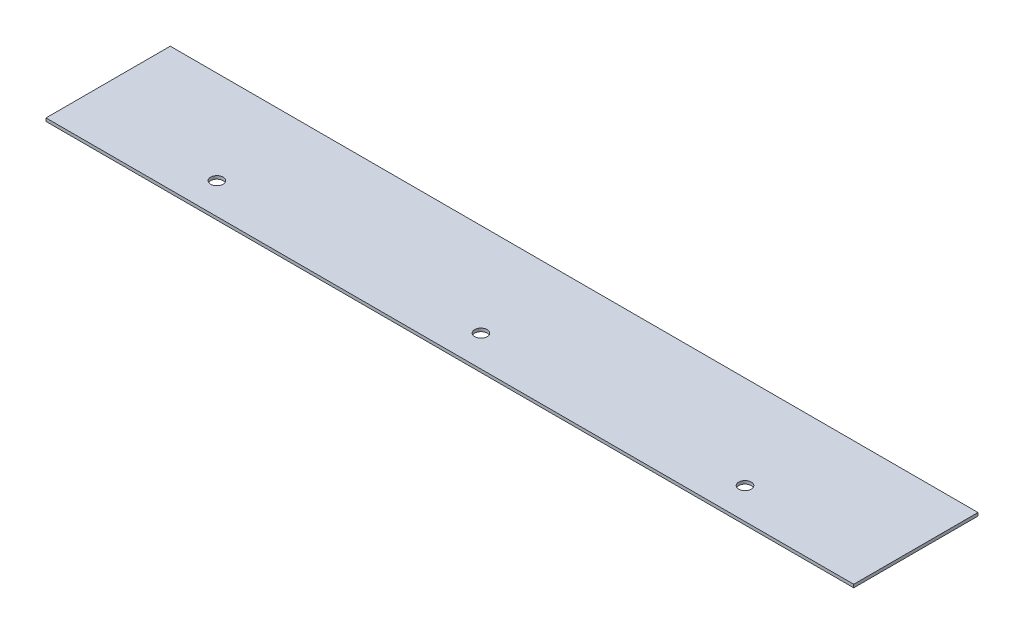
ISO-10303-21;
HEADER;
FILE_DESCRIPTION(('STEP AP214'),'2;1');
FILE_NAME('part.step','',(''),(''),'','','');
FILE_SCHEMA(('AUTOMOTIVE_DESIGN { 1 0 10303 214 1 1 1 1 }'));
ENDSEC;
DATA;
#1=APPLICATION_CONTEXT('core data for automotive mechanical design processes');
#2=APPLICATION_PROTOCOL_DEFINITION('international standard','automotive_design',2000,#1);
#3=PRODUCT_CONTEXT('',#1,'mechanical');
#4=PRODUCT('Part','Part','',(#3));
#5=PRODUCT_RELATED_PRODUCT_CATEGORY('part','',(#4));
#6=PRODUCT_DEFINITION_FORMATION('','',#4);
#7=PRODUCT_DEFINITION_CONTEXT('part definition',#1,'design');
#8=PRODUCT_DEFINITION('design','',#6,#7);
#9=PRODUCT_DEFINITION_SHAPE('','',#8);
#10=(LENGTH_UNIT() NAMED_UNIT(*) SI_UNIT(.MILLI.,.METRE.));
#11=(NAMED_UNIT(*) PLANE_ANGLE_UNIT() SI_UNIT($,.RADIAN.));
#12=(NAMED_UNIT(*) SI_UNIT($,.STERADIAN.) SOLID_ANGLE_UNIT());
#13=UNCERTAINTY_MEASURE_WITH_UNIT(LENGTH_MEASURE(1.E-05),#10,'distance_accuracy_value','');
#14=(GEOMETRIC_REPRESENTATION_CONTEXT(3) GLOBAL_UNCERTAINTY_ASSIGNED_CONTEXT((#13)) GLOBAL_UNIT_ASSIGNED_CONTEXT((#10,
#11,#12)) REPRESENTATION_CONTEXT('',''));
#15=CARTESIAN_POINT('',(0.,0.,0.));
#16=DIRECTION('',(0.,0.,1.));
#17=DIRECTION('',(1.,0.,0.));
#18=AXIS2_PLACEMENT_3D('',#15,#16,#17);
#19=CARTESIAN_POINT('',(130.,1.,0.));
#20=DIRECTION('',(1.,0.,0.));
#21=DIRECTION('',(0.,0.,-1.));
#22=AXIS2_PLACEMENT_3D('',#19,#20,#21);
#23=PLANE('',#22);
#24=DIRECTION('',(0.,0.,1.));
#25=VECTOR('',#24,1.);
#26=CARTESIAN_POINT('',(130.,0.,0.));
#27=LINE('',#26,#25);
#28=CARTESIAN_POINT('',(130.,0.,-30.));
#29=VERTEX_POINT('',#28);
#30=CARTESIAN_POINT('',(130.,0.,10.));
#31=VERTEX_POINT('',#30);
#32=EDGE_CURVE('E136',#29,#31,#27,.T.);
#33=ORIENTED_EDGE('',*,*,#32,.F.);
#34=DIRECTION('',(0.,-1.,0.));
#35=VECTOR('',#34,1.);
#36=CARTESIAN_POINT('',(130.,1.,-30.));
#37=LINE('',#36,#35);
#38=CARTESIAN_POINT('',(130.,1.,-30.));
#39=VERTEX_POINT('',#38);
#40=EDGE_CURVE('E11',#39,#29,#37,.T.);
#41=ORIENTED_EDGE('',*,*,#40,.F.);
#42=DIRECTION('',(0.,0.,1.));
#43=VECTOR('',#42,1.);
#44=CARTESIAN_POINT('',(130.,1.,0.));
#45=LINE('',#44,#43);
#46=CARTESIAN_POINT('',(130.,1.,10.));
#47=VERTEX_POINT('',#46);
#48=EDGE_CURVE('E112',#39,#47,#45,.T.);
#49=ORIENTED_EDGE('',*,*,#48,.T.);
#50=DIRECTION('',(0.,-1.,0.));
#51=VECTOR('',#50,1.);
#52=CARTESIAN_POINT('',(130.,1.,10.));
#53=LINE('',#52,#51);
#54=EDGE_CURVE('E88',#47,#31,#53,.T.);
#55=ORIENTED_EDGE('',*,*,#54,.T.);
#56=EDGE_LOOP('',(#33,#41,#49,#55));
#57=FACE_BOUND('',#56,.T.);
#58=ADVANCED_FACE('F40',(#57),#23,.T.);
#59=CARTESIAN_POINT('',(0.,1.,-30.));
#60=DIRECTION('',(0.,0.,-1.));
#61=DIRECTION('',(-1.,0.,0.));
#62=AXIS2_PLACEMENT_3D('',#59,#60,#61);
#63=PLANE('',#62);
#64=DIRECTION('',(1.,0.,0.));
#65=VECTOR('',#64,1.);
#66=CARTESIAN_POINT('',(0.,0.,-30.));
#67=LINE('',#66,#65);
#68=CARTESIAN_POINT('',(-130.,0.,-30.));
#69=VERTEX_POINT('',#68);
#70=EDGE_CURVE('E101',#69,#29,#67,.T.);
#71=ORIENTED_EDGE('',*,*,#70,.F.);
#72=DIRECTION('',(0.,-1.,0.));
#73=VECTOR('',#72,1.);
#74=CARTESIAN_POINT('',(-130.,1.,-30.));
#75=LINE('',#74,#73);
#76=CARTESIAN_POINT('',(-130.,1.,-30.));
#77=VERTEX_POINT('',#76);
#78=EDGE_CURVE('E50',#77,#69,#75,.T.);
#79=ORIENTED_EDGE('',*,*,#78,.F.);
#80=DIRECTION('',(1.,0.,0.));
#81=VECTOR('',#80,1.);
#82=CARTESIAN_POINT('',(0.,1.,-30.));
#83=LINE('',#82,#81);
#84=EDGE_CURVE('E99',#77,#39,#83,.T.);
#85=ORIENTED_EDGE('',*,*,#84,.T.);
#86=ORIENTED_EDGE('',*,*,#40,.T.);
#87=EDGE_LOOP('',(#71,#79,#85,#86));
#88=FACE_BOUND('',#87,.T.);
#89=ADVANCED_FACE('F97',(#88),#63,.T.);
#90=CARTESIAN_POINT('',(-130.,1.,0.));
#91=DIRECTION('',(1.,0.,0.));
#92=DIRECTION('',(0.,0.,-1.));
#93=AXIS2_PLACEMENT_3D('',#90,#91,#92);
#94=PLANE('',#93);
#95=DIRECTION('',(0.,0.,1.));
#96=VECTOR('',#95,1.);
#97=CARTESIAN_POINT('',(-130.,0.,0.));
#98=LINE('',#97,#96);
#99=CARTESIAN_POINT('',(-130.,0.,10.));
#100=VERTEX_POINT('',#99);
#101=EDGE_CURVE('E139',#69,#100,#98,.T.);
#102=ORIENTED_EDGE('',*,*,#101,.T.);
#103=DIRECTION('',(0.,-1.,0.));
#104=VECTOR('',#103,1.);
#105=CARTESIAN_POINT('',(-130.,1.,10.));
#106=LINE('',#105,#104);
#107=CARTESIAN_POINT('',(-130.,1.,10.));
#108=VERTEX_POINT('',#107);
#109=EDGE_CURVE('E105',#108,#100,#106,.T.);
#110=ORIENTED_EDGE('',*,*,#109,.F.);
#111=DIRECTION('',(0.,0.,1.));
#112=VECTOR('',#111,1.);
#113=CARTESIAN_POINT('',(-130.,1.,0.));
#114=LINE('',#113,#112);
#115=EDGE_CURVE('E107',#77,#108,#114,.T.);
#116=ORIENTED_EDGE('',*,*,#115,.F.);
#117=ORIENTED_EDGE('',*,*,#78,.T.);
#118=EDGE_LOOP('',(#102,#110,#116,#117));
#119=FACE_BOUND('',#118,.T.);
#120=ADVANCED_FACE('F108',(#119),#94,.F.);
#121=CARTESIAN_POINT('',(-85.,1.,0.));
#122=DIRECTION('',(0.,-1.,0.));
#123=DIRECTION('',(0.,0.,-1.));
#124=AXIS2_PLACEMENT_3D('',#121,#122,#123);
#125=CYLINDRICAL_SURFACE('',#124,2.);
#126=CARTESIAN_POINT('',(-85.,1.,0.));
#127=DIRECTION('',(0.,1.,0.));
#128=DIRECTION('',(0.,0.,1.));
#129=AXIS2_PLACEMENT_3D('',#126,#127,#128);
#130=CIRCLE('',#129,2.);
#131=CARTESIAN_POINT('',(-85.,1.,2.));
#132=VERTEX_POINT('',#131);
#133=EDGE_CURVE('E118',#132,#132,#130,.T.);
#134=ORIENTED_EDGE('',*,*,#133,.T.);
#135=EDGE_LOOP('',(#134));
#136=FACE_BOUND('',#135,.T.);
#137=CARTESIAN_POINT('',(-85.,0.,0.));
#138=DIRECTION('',(0.,1.,0.));
#139=DIRECTION('',(0.,0.,1.));
#140=AXIS2_PLACEMENT_3D('',#137,#138,#139);
#141=CIRCLE('',#140,2.);
#142=CARTESIAN_POINT('',(-85.,0.,2.));
#143=VERTEX_POINT('',#142);
#144=EDGE_CURVE('E132',#143,#143,#141,.T.);
#145=ORIENTED_EDGE('',*,*,#144,.F.);
#146=EDGE_LOOP('',(#145));
#147=FACE_BOUND('',#146,.T.);
#148=ADVANCED_FACE('F161',(#136,#147),#125,.F.);
#149=CARTESIAN_POINT('',(0.,1.,0.));
#150=DIRECTION('',(0.,-1.,0.));
#151=DIRECTION('',(0.,0.,-1.));
#152=AXIS2_PLACEMENT_3D('',#149,#150,#151);
#153=CYLINDRICAL_SURFACE('',#152,2.);
#154=CARTESIAN_POINT('',(0.,1.,0.));
#155=DIRECTION('',(0.,1.,0.));
#156=DIRECTION('',(0.,0.,1.));
#157=AXIS2_PLACEMENT_3D('',#154,#155,#156);
#158=CIRCLE('',#157,2.);
#159=CARTESIAN_POINT('',(0.,1.,2.));
#160=VERTEX_POINT('',#159);
#161=EDGE_CURVE('E174',#160,#160,#158,.T.);
#162=ORIENTED_EDGE('',*,*,#161,.T.);
#163=EDGE_LOOP('',(#162));
#164=FACE_BOUND('',#163,.T.);
#165=CARTESIAN_POINT('',(0.,0.,0.));
#166=DIRECTION('',(0.,1.,0.));
#167=DIRECTION('',(0.,0.,1.));
#168=AXIS2_PLACEMENT_3D('',#165,#166,#167);
#169=CIRCLE('',#168,2.);
#170=CARTESIAN_POINT('',(0.,0.,2.));
#171=VERTEX_POINT('',#170);
#172=EDGE_CURVE('E128',#171,#171,#169,.T.);
#173=ORIENTED_EDGE('',*,*,#172,.F.);
#174=EDGE_LOOP('',(#173));
#175=FACE_BOUND('',#174,.T.);
#176=ADVANCED_FACE('F163',(#164,#175),#153,.F.);
#177=CARTESIAN_POINT('',(85.,1.,0.));
#178=DIRECTION('',(0.,-1.,0.));
#179=DIRECTION('',(0.,0.,-1.));
#180=AXIS2_PLACEMENT_3D('',#177,#178,#179);
#181=CYLINDRICAL_SURFACE('',#180,2.);
#182=CARTESIAN_POINT('',(85.,1.,0.));
#183=DIRECTION('',(0.,1.,0.));
#184=DIRECTION('',(0.,0.,1.));
#185=AXIS2_PLACEMENT_3D('',#182,#183,#184);
#186=CIRCLE('',#185,2.);
#187=CARTESIAN_POINT('',(85.,1.,2.));
#188=VERTEX_POINT('',#187);
#189=EDGE_CURVE('E144',#188,#188,#186,.T.);
#190=ORIENTED_EDGE('',*,*,#189,.T.);
#191=EDGE_LOOP('',(#190));
#192=FACE_BOUND('',#191,.T.);
#193=CARTESIAN_POINT('',(85.,0.,0.));
#194=DIRECTION('',(0.,1.,0.));
#195=DIRECTION('',(0.,0.,1.));
#196=AXIS2_PLACEMENT_3D('',#193,#194,#195);
#197=CIRCLE('',#196,2.);
#198=CARTESIAN_POINT('',(85.,0.,2.));
#199=VERTEX_POINT('',#198);
#200=EDGE_CURVE('E124',#199,#199,#197,.T.);
#201=ORIENTED_EDGE('',*,*,#200,.F.);
#202=EDGE_LOOP('',(#201));
#203=FACE_BOUND('',#202,.T.);
#204=ADVANCED_FACE('F42',(#192,#203),#181,.F.);
#205=CARTESIAN_POINT('',(0.,1.,10.));
#206=DIRECTION('',(0.,0.,-1.));
#207=DIRECTION('',(-1.,0.,0.));
#208=AXIS2_PLACEMENT_3D('',#205,#206,#207);
#209=PLANE('',#208);
#210=DIRECTION('',(1.,0.,0.));
#211=VECTOR('',#210,1.);
#212=CARTESIAN_POINT('',(0.,0.,10.));
#213=LINE('',#212,#211);
#214=EDGE_CURVE('E81',#100,#31,#213,.T.);
#215=ORIENTED_EDGE('',*,*,#214,.T.);
#216=ORIENTED_EDGE('',*,*,#54,.F.);
#217=DIRECTION('',(1.,0.,0.));
#218=VECTOR('',#217,1.);
#219=CARTESIAN_POINT('',(0.,1.,10.));
#220=LINE('',#219,#218);
#221=EDGE_CURVE('E61',#108,#47,#220,.T.);
#222=ORIENTED_EDGE('',*,*,#221,.F.);
#223=ORIENTED_EDGE('',*,*,#109,.T.);
#224=EDGE_LOOP('',(#215,#216,#222,#223));
#225=FACE_BOUND('',#224,.T.);
#226=ADVANCED_FACE('F151',(#225),#209,.F.);
#227=CARTESIAN_POINT('',(0.,1.,0.));
#228=DIRECTION('',(0.,1.,0.));
#229=DIRECTION('',(0.,0.,1.));
#230=AXIS2_PLACEMENT_3D('',#227,#228,#229);
#231=PLANE('',#230);
#232=ORIENTED_EDGE('',*,*,#189,.F.);
#233=EDGE_LOOP('',(#232));
#234=FACE_BOUND('',#233,.T.);
#235=ORIENTED_EDGE('',*,*,#161,.F.);
#236=EDGE_LOOP('',(#235));
#237=FACE_BOUND('',#236,.T.);
#238=ORIENTED_EDGE('',*,*,#133,.F.);
#239=EDGE_LOOP('',(#238));
#240=FACE_BOUND('',#239,.T.);
#241=ORIENTED_EDGE('',*,*,#48,.F.);
#242=ORIENTED_EDGE('',*,*,#84,.F.);
#243=ORIENTED_EDGE('',*,*,#115,.T.);
#244=ORIENTED_EDGE('',*,*,#221,.T.);
#245=EDGE_LOOP('',(#241,#242,#243,#244));
#246=FACE_BOUND('',#245,.T.);
#247=ADVANCED_FACE('F111',(#234,#237,#240,#246),#231,.T.);
#248=CARTESIAN_POINT('',(0.,0.,0.));
#249=DIRECTION('',(0.,1.,0.));
#250=DIRECTION('',(0.,0.,1.));
#251=AXIS2_PLACEMENT_3D('',#248,#249,#250);
#252=PLANE('',#251);
#253=ORIENTED_EDGE('',*,*,#200,.T.);
#254=EDGE_LOOP('',(#253));
#255=FACE_BOUND('',#254,.T.);
#256=ORIENTED_EDGE('',*,*,#172,.T.);
#257=EDGE_LOOP('',(#256));
#258=FACE_BOUND('',#257,.T.);
#259=ORIENTED_EDGE('',*,*,#144,.T.);
#260=EDGE_LOOP('',(#259));
#261=FACE_BOUND('',#260,.T.);
#262=ORIENTED_EDGE('',*,*,#32,.T.);
#263=ORIENTED_EDGE('',*,*,#214,.F.);
#264=ORIENTED_EDGE('',*,*,#101,.F.);
#265=ORIENTED_EDGE('',*,*,#70,.T.);
#266=EDGE_LOOP('',(#262,#263,#264,#265));
#267=FACE_BOUND('',#266,.T.);
#268=ADVANCED_FACE('F152',(#255,#258,#261,#267),#252,.F.);
#269=CLOSED_SHELL('',(#58,#89,#120,#148,#176,#204,#226,#247,#268));
#270=MANIFOLD_SOLID_BREP('B2',#269);
#271=ADVANCED_BREP_SHAPE_REPRESENTATION('',(#18,#270),#14);
#272=SHAPE_DEFINITION_REPRESENTATION(#9,#271);
ENDSEC;
END-ISO-10303-21;
